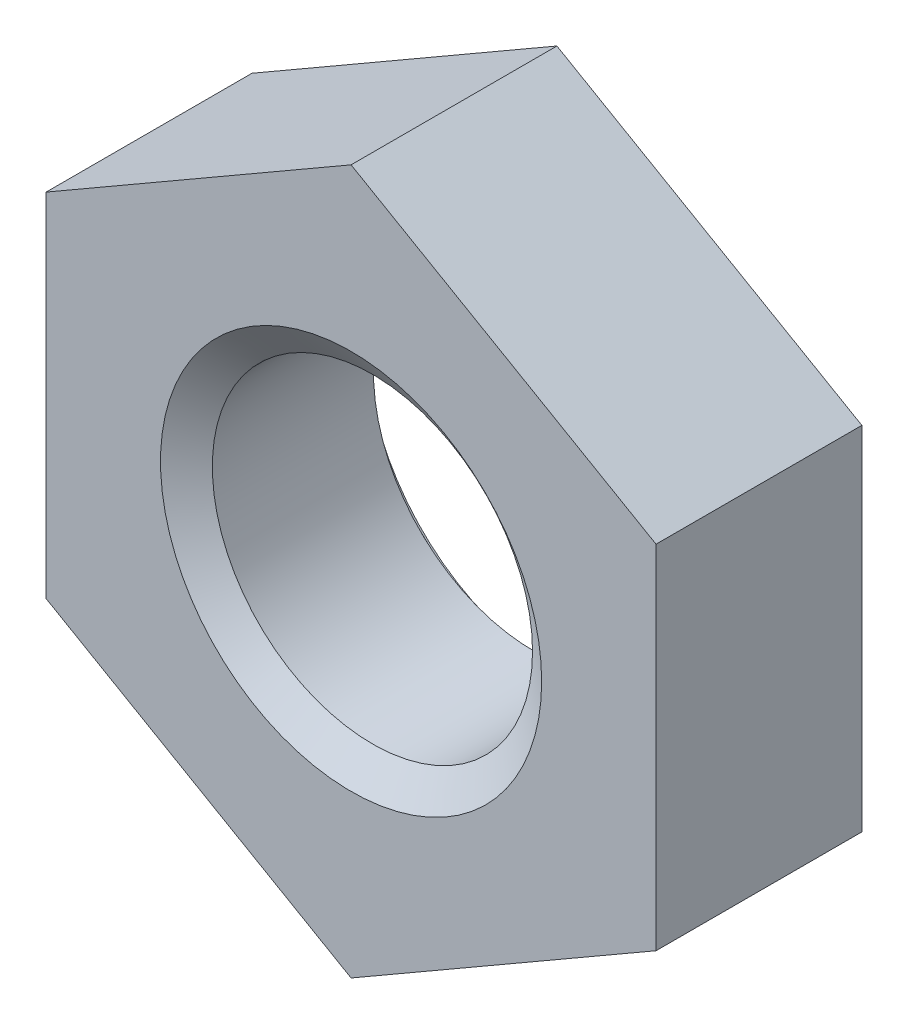
ISO-10303-21;
HEADER;
FILE_DESCRIPTION(('STEP AP214'),'2;1');
FILE_NAME('part.step','',(''),(''),'','','');
FILE_SCHEMA(('AUTOMOTIVE_DESIGN { 1 0 10303 214 1 1 1 1 }'));
ENDSEC;
DATA;
#1=APPLICATION_CONTEXT('core data for automotive mechanical design processes');
#2=APPLICATION_PROTOCOL_DEFINITION('international standard','automotive_design',2000,#1);
#3=PRODUCT_CONTEXT('',#1,'mechanical');
#4=PRODUCT('Part','Part','',(#3));
#5=PRODUCT_RELATED_PRODUCT_CATEGORY('part','',(#4));
#6=PRODUCT_DEFINITION_FORMATION('','',#4);
#7=PRODUCT_DEFINITION_CONTEXT('part definition',#1,'design');
#8=PRODUCT_DEFINITION('design','',#6,#7);
#9=PRODUCT_DEFINITION_SHAPE('','',#8);
#10=(LENGTH_UNIT() NAMED_UNIT(*) SI_UNIT(.MILLI.,.METRE.));
#11=(NAMED_UNIT(*) PLANE_ANGLE_UNIT() SI_UNIT($,.RADIAN.));
#12=(NAMED_UNIT(*) SI_UNIT($,.STERADIAN.) SOLID_ANGLE_UNIT());
#13=UNCERTAINTY_MEASURE_WITH_UNIT(LENGTH_MEASURE(1.E-05),#10,'distance_accuracy_value','');
#14=(GEOMETRIC_REPRESENTATION_CONTEXT(3) GLOBAL_UNCERTAINTY_ASSIGNED_CONTEXT((#13)) GLOBAL_UNIT_ASSIGNED_CONTEXT((#10,
#11,#12)) REPRESENTATION_CONTEXT('',''));
#15=CARTESIAN_POINT('',(0.,0.,0.));
#16=DIRECTION('',(0.,0.,1.));
#17=DIRECTION('',(1.,0.,0.));
#18=AXIS2_PLACEMENT_3D('',#15,#16,#17);
#19=CARTESIAN_POINT('',(0.,0.,-2.7));
#20=DIRECTION('',(0.,0.,1.));
#21=DIRECTION('',(1.,0.,0.));
#22=AXIS2_PLACEMENT_3D('',#19,#20,#21);
#23=CYLINDRICAL_SURFACE('',#22,2.1);
#24=CARTESIAN_POINT('',(0.,0.,-0.280083015283878));
#25=DIRECTION('',(0.,0.,1.));
#26=DIRECTION('',(1.,0.,0.));
#27=AXIS2_PLACEMENT_3D('',#24,#25,#26);
#28=CIRCLE('',#27,2.1);
#29=CARTESIAN_POINT('',(2.1,0.,-0.280083015283878));
#30=VERTEX_POINT('',#29);
#31=EDGE_CURVE('E122',#30,#30,#28,.F.);
#32=CARTESIAN_POINT('',(0.,0.,-2.39451698471612));
#33=DIRECTION('',(0.,0.,-1.));
#34=DIRECTION('',(-1.,0.,0.));
#35=AXIS2_PLACEMENT_3D('',#32,#33,#34);
#36=CIRCLE('',#35,2.1);
#37=CARTESIAN_POINT('',(2.1,0.,-2.39451698471612));
#38=VERTEX_POINT('',#37);
#39=EDGE_CURVE('E34',#38,#38,#36,.F.);
#40=CARTESIAN_POINT('',(2.1,0.,-0.280083015283878));
#41=CARTESIAN_POINT('',(2.1,0.,-0.302108369132131));
#42=CARTESIAN_POINT('',(2.1,0.,-0.324133722980383));
#43=CARTESIAN_POINT('',(2.1,0.,-0.368184430676888));
#44=CARTESIAN_POINT('',(2.1,0.,-0.390209784525141));
#45=CARTESIAN_POINT('',(2.1,0.,-0.434260492221645));
#46=CARTESIAN_POINT('',(2.1,0.,-0.456285846069898));
#47=CARTESIAN_POINT('',(2.1,0.,-0.500336553766403));
#48=CARTESIAN_POINT('',(2.1,0.,-0.522361907614656));
#49=CARTESIAN_POINT('',(2.1,0.,-0.566412615311161));
#50=CARTESIAN_POINT('',(2.1,0.,-0.588437969159413));
#51=CARTESIAN_POINT('',(2.1,0.,-0.632488676855918));
#52=CARTESIAN_POINT('',(2.1,0.,-0.65451403070417));
#53=CARTESIAN_POINT('',(2.1,0.,-0.698564738400675));
#54=CARTESIAN_POINT('',(2.1,0.,-0.720590092248928));
#55=CARTESIAN_POINT('',(2.1,0.,-0.764640799945433));
#56=CARTESIAN_POINT('',(2.1,0.,-0.786666153793685));
#57=CARTESIAN_POINT('',(2.1,0.,-0.83071686149019));
#58=CARTESIAN_POINT('',(2.1,0.,-0.852742215338443));
#59=CARTESIAN_POINT('',(2.1,0.,-0.896792923034947));
#60=CARTESIAN_POINT('',(2.1,0.,-0.9188182768832));
#61=CARTESIAN_POINT('',(2.1,0.,-0.962868984579705));
#62=CARTESIAN_POINT('',(2.1,0.,-0.984894338427957));
#63=CARTESIAN_POINT('',(2.1,0.,-1.02894504612446));
#64=CARTESIAN_POINT('',(2.1,0.,-1.05097039997271));
#65=CARTESIAN_POINT('',(2.1,0.,-1.09502110766922));
#66=CARTESIAN_POINT('',(2.1,0.,-1.11704646151747));
#67=CARTESIAN_POINT('',(2.1,0.,-1.16109716921398));
#68=CARTESIAN_POINT('',(2.1,0.,-1.18312252306223));
#69=CARTESIAN_POINT('',(2.1,0.,-1.22717323075873));
#70=CARTESIAN_POINT('',(2.1,0.,-1.24919858460699));
#71=CARTESIAN_POINT('',(2.1,0.,-1.29324929230349));
#72=CARTESIAN_POINT('',(2.1,0.,-1.31527464615174));
#73=CARTESIAN_POINT('',(2.1,0.,-1.35932535384825));
#74=CARTESIAN_POINT('',(2.1,0.,-1.3813507076965));
#75=CARTESIAN_POINT('',(2.1,0.,-1.42540141539301));
#76=CARTESIAN_POINT('',(2.1,0.,-1.44742676924126));
#77=CARTESIAN_POINT('',(2.1,0.,-1.49147747693776));
#78=CARTESIAN_POINT('',(2.1,0.,-1.51350283078602));
#79=CARTESIAN_POINT('',(2.1,0.,-1.55755353848252));
#80=CARTESIAN_POINT('',(2.1,0.,-1.57957889233077));
#81=CARTESIAN_POINT('',(2.1,0.,-1.62362960002728));
#82=CARTESIAN_POINT('',(2.1,0.,-1.64565495387553));
#83=CARTESIAN_POINT('',(2.1,0.,-1.68970566157204));
#84=CARTESIAN_POINT('',(2.1,0.,-1.71173101542029));
#85=CARTESIAN_POINT('',(2.1,0.,-1.75578172311679));
#86=CARTESIAN_POINT('',(2.1,0.,-1.77780707696505));
#87=CARTESIAN_POINT('',(2.1,0.,-1.82185778466155));
#88=CARTESIAN_POINT('',(2.1,0.,-1.8438831385098));
#89=CARTESIAN_POINT('',(2.1,0.,-1.88793384620631));
#90=CARTESIAN_POINT('',(2.1,0.,-1.90995920005456));
#91=CARTESIAN_POINT('',(2.1,0.,-1.95400990775107));
#92=CARTESIAN_POINT('',(2.1,0.,-1.97603526159932));
#93=CARTESIAN_POINT('',(2.1,0.,-2.02008596929582));
#94=CARTESIAN_POINT('',(2.1,0.,-2.04211132314408));
#95=CARTESIAN_POINT('',(2.1,0.,-2.08616203084058));
#96=CARTESIAN_POINT('',(2.1,0.,-2.10818738468883));
#97=CARTESIAN_POINT('',(2.1,0.,-2.15223809238534));
#98=CARTESIAN_POINT('',(2.1,0.,-2.17426344623359));
#99=CARTESIAN_POINT('',(2.1,0.,-2.2183141539301));
#100=CARTESIAN_POINT('',(2.1,0.,-2.24033950777835));
#101=CARTESIAN_POINT('',(2.1,0.,-2.28439021547485));
#102=CARTESIAN_POINT('',(2.1,0.,-2.30641556932311));
#103=CARTESIAN_POINT('',(2.1,0.,-2.35046627701961));
#104=CARTESIAN_POINT('',(2.1,0.,-2.37249163086786));
#105=CARTESIAN_POINT('',(2.1,0.,-2.39451698471612));
#106=B_SPLINE_CURVE_WITH_KNOTS('',3,(#40,#41,#42,#43,#44,#45,#46,#47,#48,#49,#50,#51,#52,#53,
#54,#55,#56,#57,#58,#59,#60,#61,#62,#63,#64,#65,#66,#67,#68,#69,#70,#71,#72,#73,#74,#75,#76,#77,
#78,#79,#80,#81,#82,#83,#84,#85,#86,#87,#88,#89,#90,#91,#92,#93,#94,#95,#96,#97,#98,#99,#100,
#101,#102,#103,#104,#105),.UNSPECIFIED.,.F.,.F.,(4,2,2,2,2,2,2,2,2,2,2,2,2,2,2,2,2,2,2,2,2,2,2,
2,2,2,2,2,2,2,2,2,4),(0.,0.0660760615447576,0.132152123089515,0.198228184634272,
0.26430424617903,0.330380307723787,0.396456369268544,0.462532430813302,0.528608492358059,
0.594684553902817,0.660760615447574,0.726836676992332,0.792912738537089,0.858988800081846,
0.925064861626604,0.991140923171361,1.05721698471612,1.12329304626088,1.18936910780563,
1.25544516935039,1.32152123089515,1.38759729243991,1.45367335398466,1.51974941552942,
1.58582547707418,1.65190153861894,1.71797760016369,1.78405366170845,1.85012972325321,
1.91620578479797,1.98228184634272,2.04835790788748,2.11443396943224),.UNSPECIFIED.);
#107=EDGE_CURVE('BSEAM30',#30,#38,#106,.T.);
#108=ORIENTED_EDGE('',*,*,#31,.F.);
#109=ORIENTED_EDGE('',*,*,#39,.F.);
#110=ORIENTED_EDGE('',*,*,#107,.T.);
#111=ORIENTED_EDGE('',*,*,#107,.F.);
#112=EDGE_LOOP('',(#108,#110,#109,#111));
#113=FACE_BOUND('',#112,.T.);
#114=ADVANCED_FACE('F30',(#113),#23,.F.);
#115=CARTESIAN_POINT('',(-7.99999999999996,0.,-2.7));
#116=DIRECTION('',(0.,0.,1.));
#117=DIRECTION('',(1.,0.,0.));
#118=AXIS2_PLACEMENT_3D('',#115,#116,#117);
#119=PLANE('',#118);
#120=DIRECTION('',(-0.866025403784435,-0.500000000000006,0.));
#121=VECTOR('',#120,1.);
#122=CARTESIAN_POINT('',(0.,4.61880215351702,-2.7));
#123=LINE('',#122,#121);
#124=CARTESIAN_POINT('',(0.,4.61880215351702,-2.7));
#125=VERTEX_POINT('',#124);
#126=CARTESIAN_POINT('',(-4.,2.30940107675848,-2.7));
#127=VERTEX_POINT('',#126);
#128=EDGE_CURVE('E133',#125,#127,#123,.T.);
#129=ORIENTED_EDGE('',*,*,#128,.F.);
#130=DIRECTION('',(-0.866025403784436,0.500000000000004,0.));
#131=VECTOR('',#130,1.);
#132=CARTESIAN_POINT('',(4.,2.30940107675849,-2.7));
#133=LINE('',#132,#131);
#134=CARTESIAN_POINT('',(4.,2.30940107675849,-2.7));
#135=VERTEX_POINT('',#134);
#136=EDGE_CURVE('E100',#135,#125,#133,.T.);
#137=ORIENTED_EDGE('',*,*,#136,.F.);
#138=DIRECTION('',(0.,-1.,0.));
#139=VECTOR('',#138,1.);
#140=CARTESIAN_POINT('',(4.,2.30940107675849,-2.7));
#141=LINE('',#140,#139);
#142=CARTESIAN_POINT('',(4.,-2.30940107675853,-2.7));
#143=VERTEX_POINT('',#142);
#144=EDGE_CURVE('E92',#135,#143,#141,.T.);
#145=ORIENTED_EDGE('',*,*,#144,.T.);
#146=DIRECTION('',(0.866025403784435,0.500000000000006,0.));
#147=VECTOR('',#146,1.);
#148=CARTESIAN_POINT('',(0.,-4.61880215351707,-2.7));
#149=LINE('',#148,#147);
#150=CARTESIAN_POINT('',(0.,-4.61880215351707,-2.7));
#151=VERTEX_POINT('',#150);
#152=EDGE_CURVE('E98',#151,#143,#149,.T.);
#153=ORIENTED_EDGE('',*,*,#152,.F.);
#154=DIRECTION('',(0.866025403784436,-0.500000000000004,0.));
#155=VECTOR('',#154,1.);
#156=CARTESIAN_POINT('',(-4.,-2.30940107675854,-2.7));
#157=LINE('',#156,#155);
#158=CARTESIAN_POINT('',(-4.,-2.30940107675854,-2.7));
#159=VERTEX_POINT('',#158);
#160=EDGE_CURVE('E111',#159,#151,#157,.T.);
#161=ORIENTED_EDGE('',*,*,#160,.F.);
#162=DIRECTION('',(0.,-1.,0.));
#163=VECTOR('',#162,1.);
#164=CARTESIAN_POINT('',(-4.,2.30940107675848,-2.7));
#165=LINE('',#164,#163);
#166=EDGE_CURVE('E113',#127,#159,#165,.T.);
#167=ORIENTED_EDGE('',*,*,#166,.F.);
#168=EDGE_LOOP('',(#129,#137,#145,#153,#161,#167));
#169=FACE_BOUND('',#168,.T.);
#170=CARTESIAN_POINT('',(0.,0.,-2.7));
#171=DIRECTION('',(0.,0.,1.));
#172=DIRECTION('',(1.,0.,0.));
#173=AXIS2_PLACEMENT_3D('',#170,#171,#172);
#174=CIRCLE('',#173,2.5);
#175=CARTESIAN_POINT('',(2.5,0.,-2.7));
#176=VERTEX_POINT('',#175);
#177=EDGE_CURVE('E142',#176,#176,#174,.F.);
#178=ORIENTED_EDGE('',*,*,#177,.F.);
#179=EDGE_LOOP('',(#178));
#180=FACE_BOUND('',#179,.T.);
#181=ADVANCED_FACE('F94',(#169,#180),#119,.F.);
#182=CARTESIAN_POINT('',(-7.99999999999996,0.,0.));
#183=DIRECTION('',(0.,0.,1.));
#184=DIRECTION('',(1.,0.,0.));
#185=AXIS2_PLACEMENT_3D('',#182,#183,#184);
#186=PLANE('',#185);
#187=DIRECTION('',(-0.866025403784435,-0.500000000000006,0.));
#188=VECTOR('',#187,1.);
#189=CARTESIAN_POINT('',(0.,4.61880215351702,0.));
#190=LINE('',#189,#188);
#191=CARTESIAN_POINT('',(0.,4.61880215351702,0.));
#192=VERTEX_POINT('',#191);
#193=CARTESIAN_POINT('',(-4.,2.30940107675848,0.));
#194=VERTEX_POINT('',#193);
#195=EDGE_CURVE('E118',#192,#194,#190,.T.);
#196=ORIENTED_EDGE('',*,*,#195,.T.);
#197=DIRECTION('',(0.,-1.,0.));
#198=VECTOR('',#197,1.);
#199=CARTESIAN_POINT('',(-4.,2.30940107675848,0.));
#200=LINE('',#199,#198);
#201=CARTESIAN_POINT('',(-4.,-2.30940107675854,0.));
#202=VERTEX_POINT('',#201);
#203=EDGE_CURVE('E121',#194,#202,#200,.T.);
#204=ORIENTED_EDGE('',*,*,#203,.T.);
#205=DIRECTION('',(0.866025403784436,-0.500000000000004,0.));
#206=VECTOR('',#205,1.);
#207=CARTESIAN_POINT('',(-4.,-2.30940107675854,0.));
#208=LINE('',#207,#206);
#209=CARTESIAN_POINT('',(0.,-4.61880215351707,0.));
#210=VERTEX_POINT('',#209);
#211=EDGE_CURVE('E125',#202,#210,#208,.T.);
#212=ORIENTED_EDGE('',*,*,#211,.T.);
#213=DIRECTION('',(0.866025403784435,0.500000000000006,0.));
#214=VECTOR('',#213,1.);
#215=CARTESIAN_POINT('',(0.,-4.61880215351707,0.));
#216=LINE('',#215,#214);
#217=CARTESIAN_POINT('',(4.,-2.30940107675853,0.));
#218=VERTEX_POINT('',#217);
#219=EDGE_CURVE('E128',#210,#218,#216,.T.);
#220=ORIENTED_EDGE('',*,*,#219,.T.);
#221=DIRECTION('',(0.,-1.,0.));
#222=VECTOR('',#221,1.);
#223=CARTESIAN_POINT('',(4.,2.30940107675849,0.));
#224=LINE('',#223,#222);
#225=CARTESIAN_POINT('',(4.,2.30940107675849,0.));
#226=VERTEX_POINT('',#225);
#227=EDGE_CURVE('E104',#226,#218,#224,.T.);
#228=ORIENTED_EDGE('',*,*,#227,.F.);
#229=DIRECTION('',(-0.866025403784436,0.500000000000004,0.));
#230=VECTOR('',#229,1.);
#231=CARTESIAN_POINT('',(4.,2.30940107675849,0.));
#232=LINE('',#231,#230);
#233=EDGE_CURVE('E131',#226,#192,#232,.T.);
#234=ORIENTED_EDGE('',*,*,#233,.T.);
#235=EDGE_LOOP('',(#196,#204,#212,#220,#228,#234));
#236=FACE_BOUND('',#235,.T.);
#237=CARTESIAN_POINT('',(0.,0.,0.));
#238=DIRECTION('',(0.,0.,1.));
#239=DIRECTION('',(1.,0.,0.));
#240=AXIS2_PLACEMENT_3D('',#237,#238,#239);
#241=CIRCLE('',#240,2.5);
#242=CARTESIAN_POINT('',(2.5,0.,0.));
#243=VERTEX_POINT('',#242);
#244=EDGE_CURVE('E141',#243,#243,#241,.T.);
#245=ORIENTED_EDGE('',*,*,#244,.F.);
#246=EDGE_LOOP('',(#245));
#247=FACE_BOUND('',#246,.T.);
#248=ADVANCED_FACE('F158',(#236,#247),#186,.T.);
#249=CARTESIAN_POINT('',(0.,4.61880215351702,-2.7));
#250=DIRECTION('',(-0.500000000000006,0.866025403784435,0.));
#251=DIRECTION('',(-0.866025403784436,-0.500000000000006,0.));
#252=AXIS2_PLACEMENT_3D('',#249,#250,#251);
#253=PLANE('',#252);
#254=ORIENTED_EDGE('',*,*,#195,.F.);
#255=DIRECTION('',(0.,0.,1.));
#256=VECTOR('',#255,1.);
#257=CARTESIAN_POINT('',(0.,4.61880215351702,-2.7));
#258=LINE('',#257,#256);
#259=EDGE_CURVE('E11',#125,#192,#258,.T.);
#260=ORIENTED_EDGE('',*,*,#259,.F.);
#261=ORIENTED_EDGE('',*,*,#128,.T.);
#262=DIRECTION('',(0.,0.,1.));
#263=VECTOR('',#262,1.);
#264=CARTESIAN_POINT('',(-4.,2.30940107675848,-2.7));
#265=LINE('',#264,#263);
#266=EDGE_CURVE('E81',#127,#194,#265,.T.);
#267=ORIENTED_EDGE('',*,*,#266,.T.);
#268=EDGE_LOOP('',(#254,#260,#261,#267));
#269=FACE_BOUND('',#268,.T.);
#270=ADVANCED_FACE('F32',(#269),#253,.T.);
#271=CARTESIAN_POINT('',(4.,2.30940107675849,-2.7));
#272=DIRECTION('',(0.500000000000004,0.866025403784436,0.));
#273=DIRECTION('',(-0.866025403784436,0.500000000000004,0.));
#274=AXIS2_PLACEMENT_3D('',#271,#272,#273);
#275=PLANE('',#274);
#276=ORIENTED_EDGE('',*,*,#233,.F.);
#277=DIRECTION('',(0.,0.,1.));
#278=VECTOR('',#277,1.);
#279=CARTESIAN_POINT('',(4.,2.30940107675849,-2.7));
#280=LINE('',#279,#278);
#281=EDGE_CURVE('E40',#135,#226,#280,.T.);
#282=ORIENTED_EDGE('',*,*,#281,.F.);
#283=ORIENTED_EDGE('',*,*,#136,.T.);
#284=ORIENTED_EDGE('',*,*,#259,.T.);
#285=EDGE_LOOP('',(#276,#282,#283,#284));
#286=FACE_BOUND('',#285,.T.);
#287=ADVANCED_FACE('F160',(#286),#275,.T.);
#288=CARTESIAN_POINT('',(4.,2.30940107675849,-2.7));
#289=DIRECTION('',(-1.,0.,0.));
#290=DIRECTION('',(0.,0.,1.));
#291=AXIS2_PLACEMENT_3D('',#288,#289,#290);
#292=PLANE('',#291);
#293=ORIENTED_EDGE('',*,*,#227,.T.);
#294=DIRECTION('',(0.,0.,1.));
#295=VECTOR('',#294,1.);
#296=CARTESIAN_POINT('',(4.,-2.30940107675853,-2.7));
#297=LINE('',#296,#295);
#298=EDGE_CURVE('E102',#143,#218,#297,.T.);
#299=ORIENTED_EDGE('',*,*,#298,.F.);
#300=ORIENTED_EDGE('',*,*,#144,.F.);
#301=ORIENTED_EDGE('',*,*,#281,.T.);
#302=EDGE_LOOP('',(#293,#299,#300,#301));
#303=FACE_BOUND('',#302,.T.);
#304=ADVANCED_FACE('F103',(#303),#292,.F.);
#305=CARTESIAN_POINT('',(0.,-4.61880215351707,-2.7));
#306=DIRECTION('',(0.500000000000006,-0.866025403784435,0.));
#307=DIRECTION('',(0.866025403784435,0.500000000000006,0.));
#308=AXIS2_PLACEMENT_3D('',#305,#306,#307);
#309=PLANE('',#308);
#310=ORIENTED_EDGE('',*,*,#219,.F.);
#311=DIRECTION('',(0.,0.,1.));
#312=VECTOR('',#311,1.);
#313=CARTESIAN_POINT('',(0.,-4.61880215351707,-2.7));
#314=LINE('',#313,#312);
#315=EDGE_CURVE('E108',#151,#210,#314,.T.);
#316=ORIENTED_EDGE('',*,*,#315,.F.);
#317=ORIENTED_EDGE('',*,*,#152,.T.);
#318=ORIENTED_EDGE('',*,*,#298,.T.);
#319=EDGE_LOOP('',(#310,#316,#317,#318));
#320=FACE_BOUND('',#319,.T.);
#321=ADVANCED_FACE('F110',(#320),#309,.T.);
#322=CARTESIAN_POINT('',(-4.,-2.30940107675854,-2.7));
#323=DIRECTION('',(-0.500000000000005,-0.866025403784436,0.));
#324=DIRECTION('',(0.866025403784436,-0.500000000000005,0.));
#325=AXIS2_PLACEMENT_3D('',#322,#323,#324);
#326=PLANE('',#325);
#327=ORIENTED_EDGE('',*,*,#211,.F.);
#328=DIRECTION('',(0.,0.,1.));
#329=VECTOR('',#328,1.);
#330=CARTESIAN_POINT('',(-4.,-2.30940107675854,-2.7));
#331=LINE('',#330,#329);
#332=EDGE_CURVE('E137',#159,#202,#331,.T.);
#333=ORIENTED_EDGE('',*,*,#332,.F.);
#334=ORIENTED_EDGE('',*,*,#160,.T.);
#335=ORIENTED_EDGE('',*,*,#315,.T.);
#336=EDGE_LOOP('',(#327,#333,#334,#335));
#337=FACE_BOUND('',#336,.T.);
#338=ADVANCED_FACE('F210',(#337),#326,.T.);
#339=CARTESIAN_POINT('',(-4.,2.30940107675848,-2.7));
#340=DIRECTION('',(-1.,0.,0.));
#341=DIRECTION('',(0.,0.,1.));
#342=AXIS2_PLACEMENT_3D('',#339,#340,#341);
#343=PLANE('',#342);
#344=ORIENTED_EDGE('',*,*,#203,.F.);
#345=ORIENTED_EDGE('',*,*,#266,.F.);
#346=ORIENTED_EDGE('',*,*,#166,.T.);
#347=ORIENTED_EDGE('',*,*,#332,.T.);
#348=EDGE_LOOP('',(#344,#345,#346,#347));
#349=FACE_BOUND('',#348,.T.);
#350=ADVANCED_FACE('F155',(#349),#343,.T.);
#351=CARTESIAN_POINT('',(0.,0.,-0.308091316812264));
#352=DIRECTION('',(0.,0.,1.));
#353=DIRECTION('',(1.,0.,0.));
#354=AXIS2_PLACEMENT_3D('',#351,#352,#353);
#355=CONICAL_SURFACE('',#354,2.06,0.959931088596886);
#356=ORIENTED_EDGE('',*,*,#244,.T.);
#357=EDGE_LOOP('',(#356));
#358=FACE_BOUND('',#357,.T.);
#359=ORIENTED_EDGE('',*,*,#31,.T.);
#360=EDGE_LOOP('',(#359));
#361=FACE_BOUND('',#360,.T.);
#362=ADVANCED_FACE('F179',(#358,#361),#355,.F.);
#363=CARTESIAN_POINT('',(0.,0.,-2.6746));
#364=DIRECTION('',(0.,0.,-1.));
#365=DIRECTION('',(-1.,0.,0.));
#366=AXIS2_PLACEMENT_3D('',#363,#364,#365);
#367=CONICAL_SURFACE('',#366,2.5,0.959931088596886);
#368=CARTESIAN_POINT('',(0.,0.,-2.6746));
#369=DIRECTION('',(0.,0.,1.));
#370=DIRECTION('',(1.,0.,0.));
#371=AXIS2_PLACEMENT_3D('',#368,#369,#370);
#372=CIRCLE('',#371,2.5);
#373=CARTESIAN_POINT('',(2.5,0.,-2.6746));
#374=VERTEX_POINT('',#373);
#375=EDGE_CURVE('E144',#374,#374,#372,.T.);
#376=ORIENTED_EDGE('',*,*,#375,.F.);
#377=EDGE_LOOP('',(#376));
#378=FACE_BOUND('',#377,.T.);
#379=ORIENTED_EDGE('',*,*,#39,.T.);
#380=EDGE_LOOP('',(#379));
#381=FACE_BOUND('',#380,.T.);
#382=ADVANCED_FACE('F245',(#378,#381),#367,.F.);
#383=CARTESIAN_POINT('',(0.,0.,-25.0375057290932));
#384=DIRECTION('',(0.,0.,1.));
#385=DIRECTION('',(1.,0.,0.));
#386=AXIS2_PLACEMENT_3D('',#383,#384,#385);
#387=CYLINDRICAL_SURFACE('',#386,2.5);
#388=ORIENTED_EDGE('',*,*,#375,.T.);
#389=EDGE_LOOP('',(#388));
#390=FACE_BOUND('',#389,.T.);
#391=ORIENTED_EDGE('',*,*,#177,.T.);
#392=EDGE_LOOP('',(#391));
#393=FACE_BOUND('',#392,.T.);
#394=ADVANCED_FACE('F253',(#390,#393),#387,.F.);
#395=CLOSED_SHELL('',(#114,#181,#248,#270,#287,#304,#321,#338,#350,#362,#382,#394));
#396=MANIFOLD_SOLID_BREP('B2',#395);
#397=ADVANCED_BREP_SHAPE_REPRESENTATION('',(#18,#396),#14);
#398=SHAPE_DEFINITION_REPRESENTATION(#9,#397);
ENDSEC;
END-ISO-10303-21;
